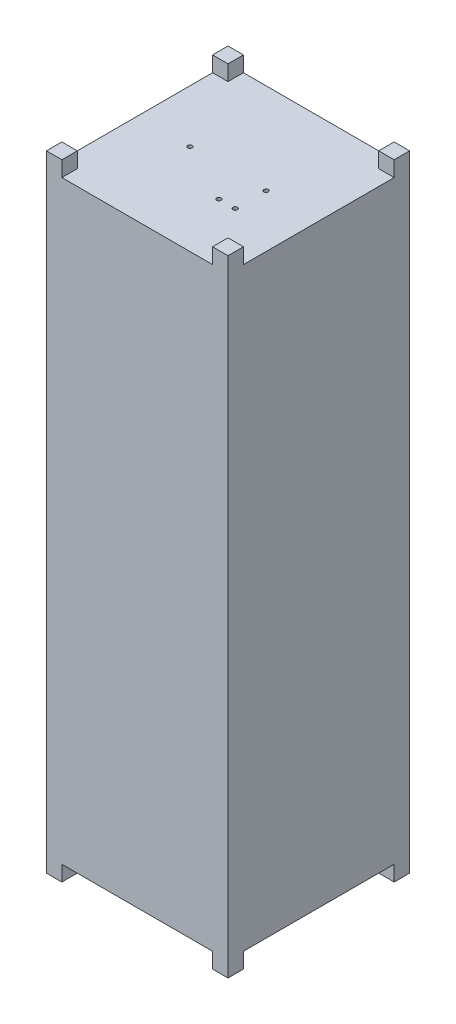
ISO-10303-21;
HEADER;
FILE_DESCRIPTION(('STEP AP214'),'2;1');
FILE_NAME('part.step','',(''),(''),'','','');
FILE_SCHEMA(('AUTOMOTIVE_DESIGN { 1 0 10303 214 1 1 1 1 }'));
ENDSEC;
DATA;
#1=APPLICATION_CONTEXT('core data for automotive mechanical design processes');
#2=APPLICATION_PROTOCOL_DEFINITION('international standard','automotive_design',2000,#1);
#3=PRODUCT_CONTEXT('',#1,'mechanical');
#4=PRODUCT('Part','Part','',(#3));
#5=PRODUCT_RELATED_PRODUCT_CATEGORY('part','',(#4));
#6=PRODUCT_DEFINITION_FORMATION('','',#4);
#7=PRODUCT_DEFINITION_CONTEXT('part definition',#1,'design');
#8=PRODUCT_DEFINITION('design','',#6,#7);
#9=PRODUCT_DEFINITION_SHAPE('','',#8);
#10=(LENGTH_UNIT() NAMED_UNIT(*) SI_UNIT(.MILLI.,.METRE.));
#11=(NAMED_UNIT(*) PLANE_ANGLE_UNIT() SI_UNIT($,.RADIAN.));
#12=(NAMED_UNIT(*) SI_UNIT($,.STERADIAN.) SOLID_ANGLE_UNIT());
#13=UNCERTAINTY_MEASURE_WITH_UNIT(LENGTH_MEASURE(1.E-05),#10,'distance_accuracy_value','');
#14=(GEOMETRIC_REPRESENTATION_CONTEXT(3) GLOBAL_UNCERTAINTY_ASSIGNED_CONTEXT((#13)) GLOBAL_UNIT_ASSIGNED_CONTEXT((#10,
#11,#12)) REPRESENTATION_CONTEXT('',''));
#15=CARTESIAN_POINT('',(0.,0.,0.));
#16=DIRECTION('',(0.,0.,1.));
#17=DIRECTION('',(1.,0.,0.));
#18=AXIS2_PLACEMENT_3D('',#15,#16,#17);
#19=CARTESIAN_POINT('',(0.,-327.5,0.));
#20=DIRECTION('',(0.,0.,1.));
#21=DIRECTION('',(1.,0.,0.));
#22=AXIS2_PLACEMENT_3D('',#19,#20,#21);
#23=PLANE('',#22);
#24=DIRECTION('',(1.,0.,0.));
#25=VECTOR('',#24,1.);
#26=CARTESIAN_POINT('',(0.,-327.5,0.));
#27=LINE('',#26,#25);
#28=CARTESIAN_POINT('',(8.5,-327.5,0.));
#29=VERTEX_POINT('',#28);
#30=CARTESIAN_POINT('',(91.5,-327.5,0.));
#31=VERTEX_POINT('',#30);
#32=EDGE_CURVE('E420',#29,#31,#27,.T.);
#33=ORIENTED_EDGE('',*,*,#32,.T.);
#34=DIRECTION('',(0.,-1.,0.));
#35=VECTOR('',#34,1.);
#36=CARTESIAN_POINT('',(91.5,8.50000000000001,0.));
#37=LINE('',#36,#35);
#38=CARTESIAN_POINT('',(91.5,-336.,0.));
#39=VERTEX_POINT('',#38);
#40=EDGE_CURVE('E231',#31,#39,#37,.T.);
#41=ORIENTED_EDGE('',*,*,#40,.T.);
#42=DIRECTION('',(-1.,0.,0.));
#43=VECTOR('',#42,1.);
#44=CARTESIAN_POINT('',(100.,-336.,0.));
#45=LINE('',#44,#43);
#46=CARTESIAN_POINT('',(100.,-336.,0.));
#47=VERTEX_POINT('',#46);
#48=EDGE_CURVE('E229',#47,#39,#45,.T.);
#49=ORIENTED_EDGE('',*,*,#48,.F.);
#50=DIRECTION('',(0.,1.,0.));
#51=VECTOR('',#50,1.);
#52=CARTESIAN_POINT('',(100.,-327.5,0.));
#53=LINE('',#52,#51);
#54=CARTESIAN_POINT('',(100.,8.50000000000001,0.));
#55=VERTEX_POINT('',#54);
#56=EDGE_CURVE('E214',#47,#55,#53,.T.);
#57=ORIENTED_EDGE('',*,*,#56,.T.);
#58=DIRECTION('',(-1.,0.,0.));
#59=VECTOR('',#58,1.);
#60=CARTESIAN_POINT('',(100.,8.50000000000001,0.));
#61=LINE('',#60,#59);
#62=CARTESIAN_POINT('',(91.5,8.50000000000001,0.));
#63=VERTEX_POINT('',#62);
#64=EDGE_CURVE('E246',#55,#63,#61,.T.);
#65=ORIENTED_EDGE('',*,*,#64,.T.);
#66=CARTESIAN_POINT('',(91.5,0.,0.));
#67=VERTEX_POINT('',#66);
#68=EDGE_CURVE('E263',#63,#67,#37,.T.);
#69=ORIENTED_EDGE('',*,*,#68,.T.);
#70=DIRECTION('',(1.,0.,0.));
#71=VECTOR('',#70,1.);
#72=CARTESIAN_POINT('',(0.,0.,0.));
#73=LINE('',#72,#71);
#74=CARTESIAN_POINT('',(8.5,0.,0.));
#75=VERTEX_POINT('',#74);
#76=EDGE_CURVE('E417',#75,#67,#73,.T.);
#77=ORIENTED_EDGE('',*,*,#76,.F.);
#78=DIRECTION('',(0.,-1.,0.));
#79=VECTOR('',#78,1.);
#80=CARTESIAN_POINT('',(8.5,8.50000000000001,0.));
#81=LINE('',#80,#79);
#82=CARTESIAN_POINT('',(8.5,8.50000000000001,0.));
#83=VERTEX_POINT('',#82);
#84=EDGE_CURVE('E296',#83,#75,#81,.T.);
#85=ORIENTED_EDGE('',*,*,#84,.F.);
#86=DIRECTION('',(-1.,0.,0.));
#87=VECTOR('',#86,1.);
#88=CARTESIAN_POINT('',(0.,8.50000000000001,0.));
#89=LINE('',#88,#87);
#90=CARTESIAN_POINT('',(0.,8.50000000000001,0.));
#91=VERTEX_POINT('',#90);
#92=EDGE_CURVE('E292',#83,#91,#89,.T.);
#93=ORIENTED_EDGE('',*,*,#92,.T.);
#94=DIRECTION('',(0.,1.,0.));
#95=VECTOR('',#94,1.);
#96=CARTESIAN_POINT('',(0.,-327.5,0.));
#97=LINE('',#96,#95);
#98=CARTESIAN_POINT('',(0.,-336.,0.));
#99=VERTEX_POINT('',#98);
#100=EDGE_CURVE('E436',#99,#91,#97,.T.);
#101=ORIENTED_EDGE('',*,*,#100,.F.);
#102=DIRECTION('',(-1.,0.,0.));
#103=VECTOR('',#102,1.);
#104=CARTESIAN_POINT('',(0.,-336.,0.));
#105=LINE('',#104,#103);
#106=CARTESIAN_POINT('',(8.5,-336.,0.));
#107=VERTEX_POINT('',#106);
#108=EDGE_CURVE('E280',#107,#99,#105,.T.);
#109=ORIENTED_EDGE('',*,*,#108,.F.);
#110=EDGE_CURVE('E300',#29,#107,#81,.T.);
#111=ORIENTED_EDGE('',*,*,#110,.F.);
#112=EDGE_LOOP('',(#33,#41,#49,#57,#65,#69,#77,#85,#93,#101,#109,#111));
#113=FACE_BOUND('',#112,.T.);
#114=ADVANCED_FACE('F35',(#113),#23,.T.);
#115=CARTESIAN_POINT('',(0.,-327.5,0.));
#116=DIRECTION('',(1.,0.,0.));
#117=DIRECTION('',(0.,0.,-1.));
#118=AXIS2_PLACEMENT_3D('',#115,#116,#117);
#119=PLANE('',#118);
#120=DIRECTION('',(0.,0.,-1.));
#121=VECTOR('',#120,1.);
#122=CARTESIAN_POINT('',(0.,-327.5,0.));
#123=LINE('',#122,#121);
#124=CARTESIAN_POINT('',(0.,-327.5,-8.5));
#125=VERTEX_POINT('',#124);
#126=CARTESIAN_POINT('',(0.,-327.5,-91.5));
#127=VERTEX_POINT('',#126);
#128=EDGE_CURVE('E226',#125,#127,#123,.T.);
#129=ORIENTED_EDGE('',*,*,#128,.F.);
#130=DIRECTION('',(0.,-1.,0.));
#131=VECTOR('',#130,1.);
#132=CARTESIAN_POINT('',(0.,8.50000000000001,-8.5));
#133=LINE('',#132,#131);
#134=CARTESIAN_POINT('',(0.,-336.,-8.5));
#135=VERTEX_POINT('',#134);
#136=EDGE_CURVE('E295',#125,#135,#133,.T.);
#137=ORIENTED_EDGE('',*,*,#136,.T.);
#138=DIRECTION('',(0.,0.,-1.));
#139=VECTOR('',#138,1.);
#140=CARTESIAN_POINT('',(0.,-336.,0.));
#141=LINE('',#140,#139);
#142=EDGE_CURVE('E271',#99,#135,#141,.T.);
#143=ORIENTED_EDGE('',*,*,#142,.F.);
#144=ORIENTED_EDGE('',*,*,#100,.T.);
#145=DIRECTION('',(0.,0.,-1.));
#146=VECTOR('',#145,1.);
#147=CARTESIAN_POINT('',(0.,8.50000000000001,0.));
#148=LINE('',#147,#146);
#149=CARTESIAN_POINT('',(0.,8.50000000000001,-8.5));
#150=VERTEX_POINT('',#149);
#151=EDGE_CURVE('E283',#91,#150,#148,.T.);
#152=ORIENTED_EDGE('',*,*,#151,.T.);
#153=CARTESIAN_POINT('',(0.,0.,-8.5));
#154=VERTEX_POINT('',#153);
#155=EDGE_CURVE('E305',#150,#154,#133,.T.);
#156=ORIENTED_EDGE('',*,*,#155,.T.);
#157=DIRECTION('',(0.,0.,-1.));
#158=VECTOR('',#157,1.);
#159=CARTESIAN_POINT('',(0.,0.,0.));
#160=LINE('',#159,#158);
#161=CARTESIAN_POINT('',(0.,0.,-91.5));
#162=VERTEX_POINT('',#161);
#163=EDGE_CURVE('E423',#154,#162,#160,.T.);
#164=ORIENTED_EDGE('',*,*,#163,.T.);
#165=DIRECTION('',(0.,-1.,0.));
#166=VECTOR('',#165,1.);
#167=CARTESIAN_POINT('',(0.,8.50000000000001,-91.5));
#168=LINE('',#167,#166);
#169=CARTESIAN_POINT('',(0.,8.50000000000001,-91.5));
#170=VERTEX_POINT('',#169);
#171=EDGE_CURVE('E380',#170,#162,#168,.T.);
#172=ORIENTED_EDGE('',*,*,#171,.F.);
#173=DIRECTION('',(0.,0.,-1.));
#174=VECTOR('',#173,1.);
#175=CARTESIAN_POINT('',(0.,8.50000000000001,-100.));
#176=LINE('',#175,#174);
#177=CARTESIAN_POINT('',(0.,8.50000000000001,-100.));
#178=VERTEX_POINT('',#177);
#179=EDGE_CURVE('E367',#170,#178,#176,.T.);
#180=ORIENTED_EDGE('',*,*,#179,.T.);
#181=DIRECTION('',(0.,1.,0.));
#182=VECTOR('',#181,1.);
#183=CARTESIAN_POINT('',(0.,-327.5,-100.));
#184=LINE('',#183,#182);
#185=CARTESIAN_POINT('',(0.,-336.,-100.));
#186=VERTEX_POINT('',#185);
#187=EDGE_CURVE('E439',#186,#178,#184,.T.);
#188=ORIENTED_EDGE('',*,*,#187,.F.);
#189=DIRECTION('',(0.,0.,-1.));
#190=VECTOR('',#189,1.);
#191=CARTESIAN_POINT('',(0.,-336.,-100.));
#192=LINE('',#191,#190);
#193=CARTESIAN_POINT('',(0.,-336.,-91.5));
#194=VERTEX_POINT('',#193);
#195=EDGE_CURVE('E355',#194,#186,#192,.T.);
#196=ORIENTED_EDGE('',*,*,#195,.F.);
#197=EDGE_CURVE('E384',#127,#194,#168,.T.);
#198=ORIENTED_EDGE('',*,*,#197,.F.);
#199=EDGE_LOOP('',(#129,#137,#143,#144,#152,#156,#164,#172,#180,#188,#196,#198));
#200=FACE_BOUND('',#199,.T.);
#201=ADVANCED_FACE('F493',(#200),#119,.F.);
#202=CARTESIAN_POINT('',(0.,-327.5,-100.));
#203=DIRECTION('',(0.,0.,1.));
#204=DIRECTION('',(1.,0.,0.));
#205=AXIS2_PLACEMENT_3D('',#202,#203,#204);
#206=PLANE('',#205);
#207=DIRECTION('',(1.,0.,0.));
#208=VECTOR('',#207,1.);
#209=CARTESIAN_POINT('',(0.,0.,-100.));
#210=LINE('',#209,#208);
#211=CARTESIAN_POINT('',(8.5,0.,-100.));
#212=VERTEX_POINT('',#211);
#213=CARTESIAN_POINT('',(91.5,0.,-100.));
#214=VERTEX_POINT('',#213);
#215=EDGE_CURVE('E432',#212,#214,#210,.T.);
#216=ORIENTED_EDGE('',*,*,#215,.T.);
#217=DIRECTION('',(0.,-1.,0.));
#218=VECTOR('',#217,1.);
#219=CARTESIAN_POINT('',(91.5,8.50000000000001,-100.));
#220=LINE('',#219,#218);
#221=CARTESIAN_POINT('',(91.5,8.50000000000001,-100.));
#222=VERTEX_POINT('',#221);
#223=EDGE_CURVE('E338',#222,#214,#220,.T.);
#224=ORIENTED_EDGE('',*,*,#223,.F.);
#225=DIRECTION('',(1.,0.,0.));
#226=VECTOR('',#225,1.);
#227=CARTESIAN_POINT('',(100.,8.50000000000001,-100.));
#228=LINE('',#227,#226);
#229=CARTESIAN_POINT('',(100.,8.50000000000001,-100.));
#230=VERTEX_POINT('',#229);
#231=EDGE_CURVE('E334',#222,#230,#228,.T.);
#232=ORIENTED_EDGE('',*,*,#231,.T.);
#233=DIRECTION('',(0.,1.,0.));
#234=VECTOR('',#233,1.);
#235=CARTESIAN_POINT('',(100.,-327.5,-100.));
#236=LINE('',#235,#234);
#237=CARTESIAN_POINT('',(100.,-336.,-100.));
#238=VERTEX_POINT('',#237);
#239=EDGE_CURVE('E225',#238,#230,#236,.T.);
#240=ORIENTED_EDGE('',*,*,#239,.F.);
#241=DIRECTION('',(1.,0.,0.));
#242=VECTOR('',#241,1.);
#243=CARTESIAN_POINT('',(100.,-336.,-100.));
#244=LINE('',#243,#242);
#245=CARTESIAN_POINT('',(91.5,-336.,-100.));
#246=VERTEX_POINT('',#245);
#247=EDGE_CURVE('E322',#246,#238,#244,.T.);
#248=ORIENTED_EDGE('',*,*,#247,.F.);
#249=CARTESIAN_POINT('',(91.5,-327.5,-100.));
#250=VERTEX_POINT('',#249);
#251=EDGE_CURVE('E342',#250,#246,#220,.T.);
#252=ORIENTED_EDGE('',*,*,#251,.F.);
#253=DIRECTION('',(1.,0.,0.));
#254=VECTOR('',#253,1.);
#255=CARTESIAN_POINT('',(0.,-327.5,-100.));
#256=LINE('',#255,#254);
#257=CARTESIAN_POINT('',(8.5,-327.5,-100.));
#258=VERTEX_POINT('',#257);
#259=EDGE_CURVE('E425',#258,#250,#256,.T.);
#260=ORIENTED_EDGE('',*,*,#259,.F.);
#261=DIRECTION('',(0.,-1.,0.));
#262=VECTOR('',#261,1.);
#263=CARTESIAN_POINT('',(8.5,8.50000000000001,-100.));
#264=LINE('',#263,#262);
#265=CARTESIAN_POINT('',(8.5,-336.,-100.));
#266=VERTEX_POINT('',#265);
#267=EDGE_CURVE('E379',#258,#266,#264,.T.);
#268=ORIENTED_EDGE('',*,*,#267,.T.);
#269=DIRECTION('',(1.,0.,0.));
#270=VECTOR('',#269,1.);
#271=CARTESIAN_POINT('',(0.,-336.,-100.));
#272=LINE('',#271,#270);
#273=EDGE_CURVE('E358',#186,#266,#272,.T.);
#274=ORIENTED_EDGE('',*,*,#273,.F.);
#275=ORIENTED_EDGE('',*,*,#187,.T.);
#276=DIRECTION('',(1.,0.,0.));
#277=VECTOR('',#276,1.);
#278=CARTESIAN_POINT('',(0.,8.50000000000001,-100.));
#279=LINE('',#278,#277);
#280=CARTESIAN_POINT('',(8.5,8.50000000000001,-100.));
#281=VERTEX_POINT('',#280);
#282=EDGE_CURVE('E370',#178,#281,#279,.T.);
#283=ORIENTED_EDGE('',*,*,#282,.T.);
#284=EDGE_CURVE('E389',#281,#212,#264,.T.);
#285=ORIENTED_EDGE('',*,*,#284,.T.);
#286=EDGE_LOOP('',(#216,#224,#232,#240,#248,#252,#260,#268,#274,#275,#283,#285));
#287=FACE_BOUND('',#286,.T.);
#288=ADVANCED_FACE('F479',(#287),#206,.F.);
#289=CARTESIAN_POINT('',(100.,-327.5,0.));
#290=DIRECTION('',(1.,0.,0.));
#291=DIRECTION('',(0.,0.,-1.));
#292=AXIS2_PLACEMENT_3D('',#289,#290,#291);
#293=PLANE('',#292);
#294=DIRECTION('',(0.,0.,-1.));
#295=VECTOR('',#294,1.);
#296=CARTESIAN_POINT('',(100.,0.,0.));
#297=LINE('',#296,#295);
#298=CARTESIAN_POINT('',(100.,0.,-8.5));
#299=VERTEX_POINT('',#298);
#300=CARTESIAN_POINT('',(100.,0.,-91.5));
#301=VERTEX_POINT('',#300);
#302=EDGE_CURVE('E430',#299,#301,#297,.T.);
#303=ORIENTED_EDGE('',*,*,#302,.F.);
#304=DIRECTION('',(0.,-1.,0.));
#305=VECTOR('',#304,1.);
#306=CARTESIAN_POINT('',(100.,8.50000000000001,-8.5));
#307=LINE('',#306,#305);
#308=CARTESIAN_POINT('',(100.,8.50000000000001,-8.5));
#309=VERTEX_POINT('',#308);
#310=EDGE_CURVE('E254',#309,#299,#307,.T.);
#311=ORIENTED_EDGE('',*,*,#310,.F.);
#312=DIRECTION('',(0.,0.,1.));
#313=VECTOR('',#312,1.);
#314=CARTESIAN_POINT('',(100.,8.50000000000001,0.));
#315=LINE('',#314,#313);
#316=EDGE_CURVE('E221',#309,#55,#315,.T.);
#317=ORIENTED_EDGE('',*,*,#316,.T.);
#318=ORIENTED_EDGE('',*,*,#56,.F.);
#319=DIRECTION('',(0.,0.,1.));
#320=VECTOR('',#319,1.);
#321=CARTESIAN_POINT('',(100.,-336.,0.));
#322=LINE('',#321,#320);
#323=CARTESIAN_POINT('',(100.,-336.,-8.5));
#324=VERTEX_POINT('',#323);
#325=EDGE_CURVE('E219',#324,#47,#322,.T.);
#326=ORIENTED_EDGE('',*,*,#325,.F.);
#327=CARTESIAN_POINT('',(100.,-327.5,-8.5));
#328=VERTEX_POINT('',#327);
#329=EDGE_CURVE('E258',#328,#324,#307,.T.);
#330=ORIENTED_EDGE('',*,*,#329,.F.);
#331=DIRECTION('',(0.,0.,-1.));
#332=VECTOR('',#331,1.);
#333=CARTESIAN_POINT('',(100.,-327.5,0.));
#334=LINE('',#333,#332);
#335=CARTESIAN_POINT('',(100.,-327.5,-91.5));
#336=VERTEX_POINT('',#335);
#337=EDGE_CURVE('E422',#328,#336,#334,.T.);
#338=ORIENTED_EDGE('',*,*,#337,.T.);
#339=DIRECTION('',(0.,-1.,0.));
#340=VECTOR('',#339,1.);
#341=CARTESIAN_POINT('',(100.,8.50000000000001,-91.5));
#342=LINE('',#341,#340);
#343=CARTESIAN_POINT('',(100.,-336.,-91.5));
#344=VERTEX_POINT('',#343);
#345=EDGE_CURVE('E337',#336,#344,#342,.T.);
#346=ORIENTED_EDGE('',*,*,#345,.T.);
#347=DIRECTION('',(0.,0.,1.));
#348=VECTOR('',#347,1.);
#349=CARTESIAN_POINT('',(100.,-336.,-100.));
#350=LINE('',#349,#348);
#351=EDGE_CURVE('E313',#238,#344,#350,.T.);
#352=ORIENTED_EDGE('',*,*,#351,.F.);
#353=ORIENTED_EDGE('',*,*,#239,.T.);
#354=DIRECTION('',(0.,0.,1.));
#355=VECTOR('',#354,1.);
#356=CARTESIAN_POINT('',(100.,8.50000000000001,-100.));
#357=LINE('',#356,#355);
#358=CARTESIAN_POINT('',(100.,8.50000000000001,-91.5));
#359=VERTEX_POINT('',#358);
#360=EDGE_CURVE('E325',#230,#359,#357,.T.);
#361=ORIENTED_EDGE('',*,*,#360,.T.);
#362=EDGE_CURVE('E347',#359,#301,#342,.T.);
#363=ORIENTED_EDGE('',*,*,#362,.T.);
#364=EDGE_LOOP('',(#303,#311,#317,#318,#326,#330,#338,#346,#352,#353,#361,#363));
#365=FACE_BOUND('',#364,.T.);
#366=ADVANCED_FACE('F216',(#365),#293,.T.);
#367=CARTESIAN_POINT('',(0.,-327.5,0.));
#368=DIRECTION('',(0.,1.,0.));
#369=DIRECTION('',(0.,0.,1.));
#370=AXIS2_PLACEMENT_3D('',#367,#368,#369);
#371=PLANE('',#370);
#372=ORIENTED_EDGE('',*,*,#337,.F.);
#373=DIRECTION('',(-1.,0.,0.));
#374=VECTOR('',#373,1.);
#375=CARTESIAN_POINT('',(0.,-327.5,-8.5000000000001));
#376=LINE('',#375,#374);
#377=CARTESIAN_POINT('',(91.5,-327.5,-8.50000000000001));
#378=VERTEX_POINT('',#377);
#379=EDGE_CURVE('E268',#328,#378,#376,.T.);
#380=ORIENTED_EDGE('',*,*,#379,.T.);
#381=DIRECTION('',(0.,0.,1.));
#382=VECTOR('',#381,1.);
#383=CARTESIAN_POINT('',(91.5,-327.5,0.));
#384=LINE('',#383,#382);
#385=EDGE_CURVE('E257',#378,#31,#384,.T.);
#386=ORIENTED_EDGE('',*,*,#385,.T.);
#387=ORIENTED_EDGE('',*,*,#32,.F.);
#388=DIRECTION('',(0.,0.,-1.));
#389=VECTOR('',#388,1.);
#390=CARTESIAN_POINT('',(8.5,-327.5,0.));
#391=LINE('',#390,#389);
#392=CARTESIAN_POINT('',(8.5,-327.5,-8.5));
#393=VERTEX_POINT('',#392);
#394=EDGE_CURVE('E310',#29,#393,#391,.T.);
#395=ORIENTED_EDGE('',*,*,#394,.T.);
#396=DIRECTION('',(-1.,0.,0.));
#397=VECTOR('',#396,1.);
#398=CARTESIAN_POINT('',(0.,-327.5,-8.5));
#399=LINE('',#398,#397);
#400=EDGE_CURVE('E299',#393,#125,#399,.T.);
#401=ORIENTED_EDGE('',*,*,#400,.T.);
#402=ORIENTED_EDGE('',*,*,#128,.T.);
#403=DIRECTION('',(1.,0.,0.));
#404=VECTOR('',#403,1.);
#405=CARTESIAN_POINT('',(0.,-327.5,-91.5));
#406=LINE('',#405,#404);
#407=CARTESIAN_POINT('',(8.5,-327.5,-91.5));
#408=VERTEX_POINT('',#407);
#409=EDGE_CURVE('E393',#127,#408,#406,.T.);
#410=ORIENTED_EDGE('',*,*,#409,.T.);
#411=DIRECTION('',(0.,0.,-1.));
#412=VECTOR('',#411,1.);
#413=CARTESIAN_POINT('',(8.49999999999996,-327.5,0.));
#414=LINE('',#413,#412);
#415=EDGE_CURVE('E383',#408,#258,#414,.T.);
#416=ORIENTED_EDGE('',*,*,#415,.T.);
#417=ORIENTED_EDGE('',*,*,#259,.T.);
#418=DIRECTION('',(0.,0.,1.));
#419=VECTOR('',#418,1.);
#420=CARTESIAN_POINT('',(91.5,-327.5,0.));
#421=LINE('',#420,#419);
#422=CARTESIAN_POINT('',(91.5,-327.5,-91.5));
#423=VERTEX_POINT('',#422);
#424=EDGE_CURVE('E352',#250,#423,#421,.T.);
#425=ORIENTED_EDGE('',*,*,#424,.T.);
#426=DIRECTION('',(1.,0.,0.));
#427=VECTOR('',#426,1.);
#428=CARTESIAN_POINT('',(0.,-327.5,-91.5));
#429=LINE('',#428,#427);
#430=EDGE_CURVE('E341',#423,#336,#429,.T.);
#431=ORIENTED_EDGE('',*,*,#430,.T.);
#432=EDGE_LOOP('',(#372,#380,#386,#387,#395,#401,#402,#410,#416,#417,#425,#431));
#433=FACE_BOUND('',#432,.T.);
#434=ADVANCED_FACE('F511',(#433),#371,.F.);
#435=CARTESIAN_POINT('',(0.,0.,0.));
#436=DIRECTION('',(0.,1.,0.));
#437=DIRECTION('',(0.,0.,1.));
#438=AXIS2_PLACEMENT_3D('',#435,#436,#437);
#439=PLANE('',#438);
#440=DIRECTION('',(-1.,0.,0.));
#441=VECTOR('',#440,1.);
#442=CARTESIAN_POINT('',(0.,0.,-8.5000000000001));
#443=LINE('',#442,#441);
#444=CARTESIAN_POINT('',(91.5,0.,-8.50000000000001));
#445=VERTEX_POINT('',#444);
#446=EDGE_CURVE('E11',#299,#445,#443,.T.);
#447=ORIENTED_EDGE('',*,*,#446,.F.);
#448=ORIENTED_EDGE('',*,*,#302,.T.);
#449=DIRECTION('',(1.,0.,0.));
#450=VECTOR('',#449,1.);
#451=CARTESIAN_POINT('',(0.,0.,-91.5));
#452=LINE('',#451,#450);
#453=CARTESIAN_POINT('',(91.5,0.,-91.5));
#454=VERTEX_POINT('',#453);
#455=EDGE_CURVE('E446',#454,#301,#452,.T.);
#456=ORIENTED_EDGE('',*,*,#455,.F.);
#457=DIRECTION('',(0.,0.,1.));
#458=VECTOR('',#457,1.);
#459=CARTESIAN_POINT('',(91.5,0.,0.));
#460=LINE('',#459,#458);
#461=EDGE_CURVE('E449',#214,#454,#460,.T.);
#462=ORIENTED_EDGE('',*,*,#461,.F.);
#463=ORIENTED_EDGE('',*,*,#215,.F.);
#464=DIRECTION('',(0.,0.,-1.));
#465=VECTOR('',#464,1.);
#466=CARTESIAN_POINT('',(8.49999999999996,0.,0.));
#467=LINE('',#466,#465);
#468=CARTESIAN_POINT('',(8.5,0.,-91.5));
#469=VERTEX_POINT('',#468);
#470=EDGE_CURVE('E438',#469,#212,#467,.T.);
#471=ORIENTED_EDGE('',*,*,#470,.F.);
#472=DIRECTION('',(1.,0.,0.));
#473=VECTOR('',#472,1.);
#474=CARTESIAN_POINT('',(0.,0.,-91.5));
#475=LINE('',#474,#473);
#476=EDGE_CURVE('E444',#162,#469,#475,.T.);
#477=ORIENTED_EDGE('',*,*,#476,.F.);
#478=ORIENTED_EDGE('',*,*,#163,.F.);
#479=DIRECTION('',(-1.,0.,0.));
#480=VECTOR('',#479,1.);
#481=CARTESIAN_POINT('',(0.,0.,-8.5));
#482=LINE('',#481,#480);
#483=CARTESIAN_POINT('',(8.5,0.,-8.5));
#484=VERTEX_POINT('',#483);
#485=EDGE_CURVE('E452',#484,#154,#482,.T.);
#486=ORIENTED_EDGE('',*,*,#485,.F.);
#487=DIRECTION('',(0.,0.,-1.));
#488=VECTOR('',#487,1.);
#489=CARTESIAN_POINT('',(8.5,0.,0.));
#490=LINE('',#489,#488);
#491=EDGE_CURVE('E455',#75,#484,#490,.T.);
#492=ORIENTED_EDGE('',*,*,#491,.F.);
#493=ORIENTED_EDGE('',*,*,#76,.T.);
#494=DIRECTION('',(0.,0.,1.));
#495=VECTOR('',#494,1.);
#496=CARTESIAN_POINT('',(91.5,0.,0.));
#497=LINE('',#496,#495);
#498=EDGE_CURVE('E42',#445,#67,#497,.T.);
#499=ORIENTED_EDGE('',*,*,#498,.F.);
#500=EDGE_LOOP('',(#447,#448,#456,#462,#463,#471,#477,#478,#486,#492,#493,#499));
#501=FACE_BOUND('',#500,.T.);
#502=CARTESIAN_POINT('',(71.,0.,-33.));
#503=DIRECTION('',(0.,1.,0.));
#504=DIRECTION('',(0.,0.,1.));
#505=AXIS2_PLACEMENT_3D('',#502,#503,#504);
#506=CIRCLE('',#505,1.2);
#507=CARTESIAN_POINT('',(71.,0.,-31.8));
#508=VERTEX_POINT('',#507);
#509=EDGE_CURVE('E395',#508,#508,#506,.T.);
#510=ORIENTED_EDGE('',*,*,#509,.F.);
#511=EDGE_LOOP('',(#510));
#512=FACE_BOUND('',#511,.T.);
#513=CARTESIAN_POINT('',(62.,0.,-33.));
#514=DIRECTION('',(0.,1.,0.));
#515=DIRECTION('',(0.,0.,1.));
#516=AXIS2_PLACEMENT_3D('',#513,#514,#515);
#517=CIRCLE('',#516,1.2);
#518=CARTESIAN_POINT('',(62.,0.,-31.8));
#519=VERTEX_POINT('',#518);
#520=EDGE_CURVE('E406',#519,#519,#517,.T.);
#521=ORIENTED_EDGE('',*,*,#520,.F.);
#522=EDGE_LOOP('',(#521));
#523=FACE_BOUND('',#522,.T.);
#524=CARTESIAN_POINT('',(29.,0.,-50.));
#525=DIRECTION('',(0.,1.,0.));
#526=DIRECTION('',(0.,0.,1.));
#527=AXIS2_PLACEMENT_3D('',#524,#525,#526);
#528=CIRCLE('',#527,1.2);
#529=CARTESIAN_POINT('',(29.,0.,-48.8));
#530=VERTEX_POINT('',#529);
#531=EDGE_CURVE('E400',#530,#530,#528,.T.);
#532=ORIENTED_EDGE('',*,*,#531,.F.);
#533=EDGE_LOOP('',(#532));
#534=FACE_BOUND('',#533,.T.);
#535=CARTESIAN_POINT('',(71.,0.,-50.));
#536=DIRECTION('',(0.,1.,0.));
#537=DIRECTION('',(0.,0.,1.));
#538=AXIS2_PLACEMENT_3D('',#535,#536,#537);
#539=CIRCLE('',#538,1.2);
#540=CARTESIAN_POINT('',(71.,0.,-48.8));
#541=VERTEX_POINT('',#540);
#542=EDGE_CURVE('E399',#541,#541,#539,.T.);
#543=ORIENTED_EDGE('',*,*,#542,.F.);
#544=EDGE_LOOP('',(#543));
#545=FACE_BOUND('',#544,.T.);
#546=ADVANCED_FACE('F466',(#501,#512,#523,#534,#545),#439,.T.);
#547=CARTESIAN_POINT('',(71.,-10.,-50.));
#548=DIRECTION('',(0.,1.,0.));
#549=DIRECTION('',(0.,0.,1.));
#550=AXIS2_PLACEMENT_3D('',#547,#548,#549);
#551=CYLINDRICAL_SURFACE('',#550,1.2);
#552=CARTESIAN_POINT('',(71.,-10.,-50.));
#553=DIRECTION('',(0.,1.,0.));
#554=DIRECTION('',(0.,0.,1.));
#555=AXIS2_PLACEMENT_3D('',#552,#553,#554);
#556=CIRCLE('',#555,1.2);
#557=CARTESIAN_POINT('',(71.,-10.,-48.8));
#558=VERTEX_POINT('',#557);
#559=EDGE_CURVE('E414',#558,#558,#556,.T.);
#560=ORIENTED_EDGE('',*,*,#559,.F.);
#561=EDGE_LOOP('',(#560));
#562=FACE_BOUND('',#561,.T.);
#563=ORIENTED_EDGE('',*,*,#542,.T.);
#564=EDGE_LOOP('',(#563));
#565=FACE_BOUND('',#564,.T.);
#566=ADVANCED_FACE('F561',(#562,#565),#551,.F.);
#567=CARTESIAN_POINT('',(71.,-10.,-50.));
#568=DIRECTION('',(0.,1.,0.));
#569=DIRECTION('',(0.,0.,1.));
#570=AXIS2_PLACEMENT_3D('',#567,#568,#569);
#571=PLANE('',#570);
#572=ORIENTED_EDGE('',*,*,#559,.T.);
#573=EDGE_LOOP('',(#572));
#574=FACE_BOUND('',#573,.T.);
#575=ADVANCED_FACE('F565',(#574),#571,.T.);
#576=CARTESIAN_POINT('',(29.,-10.,-50.));
#577=DIRECTION('',(0.,1.,0.));
#578=DIRECTION('',(0.,0.,1.));
#579=AXIS2_PLACEMENT_3D('',#576,#577,#578);
#580=CYLINDRICAL_SURFACE('',#579,1.2);
#581=CARTESIAN_POINT('',(29.,-10.,-50.));
#582=DIRECTION('',(0.,1.,0.));
#583=DIRECTION('',(0.,0.,1.));
#584=AXIS2_PLACEMENT_3D('',#581,#582,#583);
#585=CIRCLE('',#584,1.2);
#586=CARTESIAN_POINT('',(29.,-10.,-48.8));
#587=VERTEX_POINT('',#586);
#588=EDGE_CURVE('E396',#587,#587,#585,.T.);
#589=ORIENTED_EDGE('',*,*,#588,.F.);
#590=EDGE_LOOP('',(#589));
#591=FACE_BOUND('',#590,.T.);
#592=ORIENTED_EDGE('',*,*,#531,.T.);
#593=EDGE_LOOP('',(#592));
#594=FACE_BOUND('',#593,.T.);
#595=ADVANCED_FACE('F569',(#591,#594),#580,.F.);
#596=CARTESIAN_POINT('',(29.,-10.,-50.));
#597=DIRECTION('',(0.,1.,0.));
#598=DIRECTION('',(0.,0.,1.));
#599=AXIS2_PLACEMENT_3D('',#596,#597,#598);
#600=PLANE('',#599);
#601=ORIENTED_EDGE('',*,*,#588,.T.);
#602=EDGE_LOOP('',(#601));
#603=FACE_BOUND('',#602,.T.);
#604=ADVANCED_FACE('F583',(#603),#600,.T.);
#605=CARTESIAN_POINT('',(62.,-10.,-33.));
#606=DIRECTION('',(0.,1.,0.));
#607=DIRECTION('',(0.,0.,1.));
#608=AXIS2_PLACEMENT_3D('',#605,#606,#607);
#609=CYLINDRICAL_SURFACE('',#608,1.2);
#610=CARTESIAN_POINT('',(62.,-10.,-33.));
#611=DIRECTION('',(0.,1.,0.));
#612=DIRECTION('',(0.,0.,1.));
#613=AXIS2_PLACEMENT_3D('',#610,#611,#612);
#614=CIRCLE('',#613,1.2);
#615=CARTESIAN_POINT('',(62.,-10.,-31.8));
#616=VERTEX_POINT('',#615);
#617=EDGE_CURVE('E403',#616,#616,#614,.T.);
#618=ORIENTED_EDGE('',*,*,#617,.F.);
#619=EDGE_LOOP('',(#618));
#620=FACE_BOUND('',#619,.T.);
#621=ORIENTED_EDGE('',*,*,#520,.T.);
#622=EDGE_LOOP('',(#621));
#623=FACE_BOUND('',#622,.T.);
#624=ADVANCED_FACE('F580',(#620,#623),#609,.F.);
#625=CARTESIAN_POINT('',(62.,-10.,-33.));
#626=DIRECTION('',(0.,1.,0.));
#627=DIRECTION('',(0.,0.,1.));
#628=AXIS2_PLACEMENT_3D('',#625,#626,#627);
#629=PLANE('',#628);
#630=ORIENTED_EDGE('',*,*,#617,.T.);
#631=EDGE_LOOP('',(#630));
#632=FACE_BOUND('',#631,.T.);
#633=ADVANCED_FACE('F575',(#632),#629,.T.);
#634=CARTESIAN_POINT('',(71.,-10.,-33.));
#635=DIRECTION('',(0.,1.,0.));
#636=DIRECTION('',(0.,0.,1.));
#637=AXIS2_PLACEMENT_3D('',#634,#635,#636);
#638=CYLINDRICAL_SURFACE('',#637,1.2);
#639=CARTESIAN_POINT('',(71.,-10.,-33.));
#640=DIRECTION('',(0.,1.,0.));
#641=DIRECTION('',(0.,0.,1.));
#642=AXIS2_PLACEMENT_3D('',#639,#640,#641);
#643=CIRCLE('',#642,1.2);
#644=CARTESIAN_POINT('',(71.,-10.,-31.8));
#645=VERTEX_POINT('',#644);
#646=EDGE_CURVE('E409',#645,#645,#643,.T.);
#647=ORIENTED_EDGE('',*,*,#646,.F.);
#648=EDGE_LOOP('',(#647));
#649=FACE_BOUND('',#648,.T.);
#650=ORIENTED_EDGE('',*,*,#509,.T.);
#651=EDGE_LOOP('',(#650));
#652=FACE_BOUND('',#651,.T.);
#653=ADVANCED_FACE('F571',(#649,#652),#638,.F.);
#654=CARTESIAN_POINT('',(71.,-10.,-33.));
#655=DIRECTION('',(0.,1.,0.));
#656=DIRECTION('',(0.,0.,1.));
#657=AXIS2_PLACEMENT_3D('',#654,#655,#656);
#658=PLANE('',#657);
#659=ORIENTED_EDGE('',*,*,#646,.T.);
#660=EDGE_LOOP('',(#659));
#661=FACE_BOUND('',#660,.T.);
#662=ADVANCED_FACE('F574',(#661),#658,.T.);
#663=CARTESIAN_POINT('',(0.,8.50000000000001,0.));
#664=DIRECTION('',(0.,1.,0.));
#665=DIRECTION('',(0.,0.,1.));
#666=AXIS2_PLACEMENT_3D('',#663,#664,#665);
#667=PLANE('',#666);
#668=ORIENTED_EDGE('',*,*,#179,.F.);
#669=DIRECTION('',(-1.,0.,0.));
#670=VECTOR('',#669,1.);
#671=CARTESIAN_POINT('',(0.,8.50000000000001,-91.5));
#672=LINE('',#671,#670);
#673=CARTESIAN_POINT('',(8.5,8.50000000000001,-91.5));
#674=VERTEX_POINT('',#673);
#675=EDGE_CURVE('E376',#674,#170,#672,.T.);
#676=ORIENTED_EDGE('',*,*,#675,.F.);
#677=DIRECTION('',(0.,0.,1.));
#678=VECTOR('',#677,1.);
#679=CARTESIAN_POINT('',(8.5,8.50000000000001,-100.));
#680=LINE('',#679,#678);
#681=EDGE_CURVE('E373',#281,#674,#680,.T.);
#682=ORIENTED_EDGE('',*,*,#681,.F.);
#683=ORIENTED_EDGE('',*,*,#282,.F.);
#684=EDGE_LOOP('',(#668,#676,#682,#683));
#685=FACE_BOUND('',#684,.T.);
#686=ADVANCED_FACE('F496',(#685),#667,.T.);
#687=CARTESIAN_POINT('',(8.5,8.50000000000001,-100.));
#688=DIRECTION('',(1.,0.,0.));
#689=DIRECTION('',(0.,0.,-1.));
#690=AXIS2_PLACEMENT_3D('',#687,#688,#689);
#691=PLANE('',#690);
#692=DIRECTION('',(0.,-1.,0.));
#693=VECTOR('',#692,1.);
#694=CARTESIAN_POINT('',(8.5,8.50000000000001,-91.5));
#695=LINE('',#694,#693);
#696=EDGE_CURVE('E385',#674,#469,#695,.T.);
#697=ORIENTED_EDGE('',*,*,#696,.T.);
#698=ORIENTED_EDGE('',*,*,#470,.T.);
#699=ORIENTED_EDGE('',*,*,#284,.F.);
#700=ORIENTED_EDGE('',*,*,#681,.T.);
#701=EDGE_LOOP('',(#697,#698,#699,#700));
#702=FACE_BOUND('',#701,.T.);
#703=ADVANCED_FACE('F485',(#702),#691,.T.);
#704=CARTESIAN_POINT('',(0.,8.50000000000001,-91.5));
#705=DIRECTION('',(0.,0.,1.));
#706=DIRECTION('',(1.,0.,0.));
#707=AXIS2_PLACEMENT_3D('',#704,#705,#706);
#708=PLANE('',#707);
#709=ORIENTED_EDGE('',*,*,#171,.T.);
#710=ORIENTED_EDGE('',*,*,#476,.T.);
#711=ORIENTED_EDGE('',*,*,#696,.F.);
#712=ORIENTED_EDGE('',*,*,#675,.T.);
#713=EDGE_LOOP('',(#709,#710,#711,#712));
#714=FACE_BOUND('',#713,.T.);
#715=ADVANCED_FACE('F489',(#714),#708,.T.);
#716=ORIENTED_EDGE('',*,*,#409,.F.);
#717=ORIENTED_EDGE('',*,*,#197,.T.);
#718=DIRECTION('',(-1.,0.,0.));
#719=VECTOR('',#718,1.);
#720=CARTESIAN_POINT('',(0.,-336.,-91.5));
#721=LINE('',#720,#719);
#722=CARTESIAN_POINT('',(8.5,-336.,-91.5));
#723=VERTEX_POINT('',#722);
#724=EDGE_CURVE('E364',#723,#194,#721,.T.);
#725=ORIENTED_EDGE('',*,*,#724,.F.);
#726=EDGE_CURVE('E388',#408,#723,#695,.T.);
#727=ORIENTED_EDGE('',*,*,#726,.F.);
#728=EDGE_LOOP('',(#716,#717,#725,#727));
#729=FACE_BOUND('',#728,.T.);
#730=ADVANCED_FACE('F507',(#729),#708,.T.);
#731=ORIENTED_EDGE('',*,*,#415,.F.);
#732=ORIENTED_EDGE('',*,*,#726,.T.);
#733=DIRECTION('',(0.,0.,1.));
#734=VECTOR('',#733,1.);
#735=CARTESIAN_POINT('',(8.5,-336.,-100.));
#736=LINE('',#735,#734);
#737=EDGE_CURVE('E361',#266,#723,#736,.T.);
#738=ORIENTED_EDGE('',*,*,#737,.F.);
#739=ORIENTED_EDGE('',*,*,#267,.F.);
#740=EDGE_LOOP('',(#731,#732,#738,#739));
#741=FACE_BOUND('',#740,.T.);
#742=ADVANCED_FACE('F514',(#741),#691,.T.);
#743=CARTESIAN_POINT('',(0.,-336.,0.));
#744=DIRECTION('',(0.,1.,0.));
#745=DIRECTION('',(0.,0.,1.));
#746=AXIS2_PLACEMENT_3D('',#743,#744,#745);
#747=PLANE('',#746);
#748=ORIENTED_EDGE('',*,*,#195,.T.);
#749=ORIENTED_EDGE('',*,*,#273,.T.);
#750=ORIENTED_EDGE('',*,*,#737,.T.);
#751=ORIENTED_EDGE('',*,*,#724,.T.);
#752=EDGE_LOOP('',(#748,#749,#750,#751));
#753=FACE_BOUND('',#752,.T.);
#754=ADVANCED_FACE('F501',(#753),#747,.F.);
#755=CARTESIAN_POINT('',(0.,8.50000000000001,0.));
#756=DIRECTION('',(0.,-1.,0.));
#757=DIRECTION('',(0.,0.,-1.));
#758=AXIS2_PLACEMENT_3D('',#755,#756,#757);
#759=PLANE('',#758);
#760=ORIENTED_EDGE('',*,*,#360,.F.);
#761=ORIENTED_EDGE('',*,*,#231,.F.);
#762=DIRECTION('',(0.,0.,-1.));
#763=VECTOR('',#762,1.);
#764=CARTESIAN_POINT('',(91.5,8.50000000000001,-100.));
#765=LINE('',#764,#763);
#766=CARTESIAN_POINT('',(91.5,8.50000000000001,-91.5));
#767=VERTEX_POINT('',#766);
#768=EDGE_CURVE('E331',#767,#222,#765,.T.);
#769=ORIENTED_EDGE('',*,*,#768,.F.);
#770=DIRECTION('',(-1.,0.,0.));
#771=VECTOR('',#770,1.);
#772=CARTESIAN_POINT('',(100.,8.50000000000001,-91.5));
#773=LINE('',#772,#771);
#774=EDGE_CURVE('E328',#359,#767,#773,.T.);
#775=ORIENTED_EDGE('',*,*,#774,.F.);
#776=EDGE_LOOP('',(#760,#761,#769,#775));
#777=FACE_BOUND('',#776,.T.);
#778=ADVANCED_FACE('F477',(#777),#759,.F.);
#779=CARTESIAN_POINT('',(100.,8.50000000000001,-91.5));
#780=DIRECTION('',(0.,0.,1.));
#781=DIRECTION('',(1.,0.,0.));
#782=AXIS2_PLACEMENT_3D('',#779,#780,#781);
#783=PLANE('',#782);
#784=DIRECTION('',(0.,-1.,0.));
#785=VECTOR('',#784,1.);
#786=CARTESIAN_POINT('',(91.5,8.50000000000001,-91.5));
#787=LINE('',#786,#785);
#788=EDGE_CURVE('E343',#767,#454,#787,.T.);
#789=ORIENTED_EDGE('',*,*,#788,.T.);
#790=ORIENTED_EDGE('',*,*,#455,.T.);
#791=ORIENTED_EDGE('',*,*,#362,.F.);
#792=ORIENTED_EDGE('',*,*,#774,.T.);
#793=EDGE_LOOP('',(#789,#790,#791,#792));
#794=FACE_BOUND('',#793,.T.);
#795=ADVANCED_FACE('F469',(#794),#783,.T.);
#796=CARTESIAN_POINT('',(91.5,8.50000000000001,-100.));
#797=DIRECTION('',(-1.,0.,0.));
#798=DIRECTION('',(0.,0.,1.));
#799=AXIS2_PLACEMENT_3D('',#796,#797,#798);
#800=PLANE('',#799);
#801=ORIENTED_EDGE('',*,*,#223,.T.);
#802=ORIENTED_EDGE('',*,*,#461,.T.);
#803=ORIENTED_EDGE('',*,*,#788,.F.);
#804=ORIENTED_EDGE('',*,*,#768,.T.);
#805=EDGE_LOOP('',(#801,#802,#803,#804));
#806=FACE_BOUND('',#805,.T.);
#807=ADVANCED_FACE('F473',(#806),#800,.T.);
#808=ORIENTED_EDGE('',*,*,#424,.F.);
#809=ORIENTED_EDGE('',*,*,#251,.T.);
#810=DIRECTION('',(0.,0.,-1.));
#811=VECTOR('',#810,1.);
#812=CARTESIAN_POINT('',(91.5,-336.,-100.));
#813=LINE('',#812,#811);
#814=CARTESIAN_POINT('',(91.5,-336.,-91.5));
#815=VERTEX_POINT('',#814);
#816=EDGE_CURVE('E319',#815,#246,#813,.T.);
#817=ORIENTED_EDGE('',*,*,#816,.F.);
#818=EDGE_CURVE('E346',#423,#815,#787,.T.);
#819=ORIENTED_EDGE('',*,*,#818,.F.);
#820=EDGE_LOOP('',(#808,#809,#817,#819));
#821=FACE_BOUND('',#820,.T.);
#822=ADVANCED_FACE('F518',(#821),#800,.T.);
#823=ORIENTED_EDGE('',*,*,#430,.F.);
#824=ORIENTED_EDGE('',*,*,#818,.T.);
#825=DIRECTION('',(-1.,0.,0.));
#826=VECTOR('',#825,1.);
#827=CARTESIAN_POINT('',(100.,-336.,-91.5));
#828=LINE('',#827,#826);
#829=EDGE_CURVE('E316',#344,#815,#828,.T.);
#830=ORIENTED_EDGE('',*,*,#829,.F.);
#831=ORIENTED_EDGE('',*,*,#345,.F.);
#832=EDGE_LOOP('',(#823,#824,#830,#831));
#833=FACE_BOUND('',#832,.T.);
#834=ADVANCED_FACE('F522',(#833),#783,.T.);
#835=CARTESIAN_POINT('',(0.,-336.,0.));
#836=DIRECTION('',(0.,-1.,0.));
#837=DIRECTION('',(0.,0.,-1.));
#838=AXIS2_PLACEMENT_3D('',#835,#836,#837);
#839=PLANE('',#838);
#840=ORIENTED_EDGE('',*,*,#351,.T.);
#841=ORIENTED_EDGE('',*,*,#829,.T.);
#842=ORIENTED_EDGE('',*,*,#816,.T.);
#843=ORIENTED_EDGE('',*,*,#247,.T.);
#844=EDGE_LOOP('',(#840,#841,#842,#843));
#845=FACE_BOUND('',#844,.T.);
#846=ADVANCED_FACE('F525',(#845),#839,.T.);
#847=CARTESIAN_POINT('',(0.,8.50000000000001,0.));
#848=DIRECTION('',(0.,-1.,0.));
#849=DIRECTION('',(0.,0.,-1.));
#850=AXIS2_PLACEMENT_3D('',#847,#848,#849);
#851=PLANE('',#850);
#852=ORIENTED_EDGE('',*,*,#151,.F.);
#853=ORIENTED_EDGE('',*,*,#92,.F.);
#854=DIRECTION('',(0.,0.,1.));
#855=VECTOR('',#854,1.);
#856=CARTESIAN_POINT('',(8.5,8.50000000000001,0.));
#857=LINE('',#856,#855);
#858=CARTESIAN_POINT('',(8.5,8.50000000000001,-8.5));
#859=VERTEX_POINT('',#858);
#860=EDGE_CURVE('E289',#859,#83,#857,.T.);
#861=ORIENTED_EDGE('',*,*,#860,.F.);
#862=DIRECTION('',(1.,0.,0.));
#863=VECTOR('',#862,1.);
#864=CARTESIAN_POINT('',(0.,8.50000000000001,-8.5));
#865=LINE('',#864,#863);
#866=EDGE_CURVE('E286',#150,#859,#865,.T.);
#867=ORIENTED_EDGE('',*,*,#866,.F.);
#868=EDGE_LOOP('',(#852,#853,#861,#867));
#869=FACE_BOUND('',#868,.T.);
#870=ADVANCED_FACE('F610',(#869),#851,.F.);
#871=CARTESIAN_POINT('',(0.,8.50000000000001,-8.5));
#872=DIRECTION('',(0.,0.,-1.));
#873=DIRECTION('',(-1.,0.,0.));
#874=AXIS2_PLACEMENT_3D('',#871,#872,#873);
#875=PLANE('',#874);
#876=DIRECTION('',(0.,-1.,0.));
#877=VECTOR('',#876,1.);
#878=CARTESIAN_POINT('',(8.5,8.50000000000001,-8.5));
#879=LINE('',#878,#877);
#880=EDGE_CURVE('E301',#859,#484,#879,.T.);
#881=ORIENTED_EDGE('',*,*,#880,.T.);
#882=ORIENTED_EDGE('',*,*,#485,.T.);
#883=ORIENTED_EDGE('',*,*,#155,.F.);
#884=ORIENTED_EDGE('',*,*,#866,.T.);
#885=EDGE_LOOP('',(#881,#882,#883,#884));
#886=FACE_BOUND('',#885,.T.);
#887=ADVANCED_FACE('F611',(#886),#875,.T.);
#888=CARTESIAN_POINT('',(8.5,8.50000000000001,0.));
#889=DIRECTION('',(1.,0.,0.));
#890=DIRECTION('',(0.,0.,-1.));
#891=AXIS2_PLACEMENT_3D('',#888,#889,#890);
#892=PLANE('',#891);
#893=ORIENTED_EDGE('',*,*,#84,.T.);
#894=ORIENTED_EDGE('',*,*,#491,.T.);
#895=ORIENTED_EDGE('',*,*,#880,.F.);
#896=ORIENTED_EDGE('',*,*,#860,.T.);
#897=EDGE_LOOP('',(#893,#894,#895,#896));
#898=FACE_BOUND('',#897,.T.);
#899=ADVANCED_FACE('F614',(#898),#892,.T.);
#900=ORIENTED_EDGE('',*,*,#394,.F.);
#901=ORIENTED_EDGE('',*,*,#110,.T.);
#902=DIRECTION('',(0.,0.,1.));
#903=VECTOR('',#902,1.);
#904=CARTESIAN_POINT('',(8.5,-336.,0.));
#905=LINE('',#904,#903);
#906=CARTESIAN_POINT('',(8.5,-336.,-8.5));
#907=VERTEX_POINT('',#906);
#908=EDGE_CURVE('E277',#907,#107,#905,.T.);
#909=ORIENTED_EDGE('',*,*,#908,.F.);
#910=EDGE_CURVE('E304',#393,#907,#879,.T.);
#911=ORIENTED_EDGE('',*,*,#910,.F.);
#912=EDGE_LOOP('',(#900,#901,#909,#911));
#913=FACE_BOUND('',#912,.T.);
#914=ADVANCED_FACE('F619',(#913),#892,.T.);
#915=ORIENTED_EDGE('',*,*,#400,.F.);
#916=ORIENTED_EDGE('',*,*,#910,.T.);
#917=DIRECTION('',(1.,0.,0.));
#918=VECTOR('',#917,1.);
#919=CARTESIAN_POINT('',(0.,-336.,-8.5));
#920=LINE('',#919,#918);
#921=EDGE_CURVE('E274',#135,#907,#920,.T.);
#922=ORIENTED_EDGE('',*,*,#921,.F.);
#923=ORIENTED_EDGE('',*,*,#136,.F.);
#924=EDGE_LOOP('',(#915,#916,#922,#923));
#925=FACE_BOUND('',#924,.T.);
#926=ADVANCED_FACE('F616',(#925),#875,.T.);
#927=CARTESIAN_POINT('',(0.,-336.,0.));
#928=DIRECTION('',(0.,-1.,0.));
#929=DIRECTION('',(0.,0.,-1.));
#930=AXIS2_PLACEMENT_3D('',#927,#928,#929);
#931=PLANE('',#930);
#932=ORIENTED_EDGE('',*,*,#142,.T.);
#933=ORIENTED_EDGE('',*,*,#921,.T.);
#934=ORIENTED_EDGE('',*,*,#908,.T.);
#935=ORIENTED_EDGE('',*,*,#108,.T.);
#936=EDGE_LOOP('',(#932,#933,#934,#935));
#937=FACE_BOUND('',#936,.T.);
#938=ADVANCED_FACE('F623',(#937),#931,.T.);
#939=CARTESIAN_POINT('',(0.,8.50000000000001,0.));
#940=DIRECTION('',(0.,1.,0.));
#941=DIRECTION('',(0.,0.,1.));
#942=AXIS2_PLACEMENT_3D('',#939,#940,#941);
#943=PLANE('',#942);
#944=ORIENTED_EDGE('',*,*,#316,.F.);
#945=DIRECTION('',(1.,0.,0.));
#946=VECTOR('',#945,1.);
#947=CARTESIAN_POINT('',(100.,8.50000000000001,-8.5));
#948=LINE('',#947,#946);
#949=CARTESIAN_POINT('',(91.5,8.50000000000001,-8.50000000000001));
#950=VERTEX_POINT('',#949);
#951=EDGE_CURVE('E251',#950,#309,#948,.T.);
#952=ORIENTED_EDGE('',*,*,#951,.F.);
#953=DIRECTION('',(0.,0.,-1.));
#954=VECTOR('',#953,1.);
#955=CARTESIAN_POINT('',(91.5,8.50000000000001,0.));
#956=LINE('',#955,#954);
#957=EDGE_CURVE('E248',#63,#950,#956,.T.);
#958=ORIENTED_EDGE('',*,*,#957,.F.);
#959=ORIENTED_EDGE('',*,*,#64,.F.);
#960=EDGE_LOOP('',(#944,#952,#958,#959));
#961=FACE_BOUND('',#960,.T.);
#962=ADVANCED_FACE('F462',(#961),#943,.T.);
#963=CARTESIAN_POINT('',(91.5,8.50000000000001,0.));
#964=DIRECTION('',(-1.,0.,0.));
#965=DIRECTION('',(0.,0.,1.));
#966=AXIS2_PLACEMENT_3D('',#963,#964,#965);
#967=PLANE('',#966);
#968=DIRECTION('',(0.,-1.,0.));
#969=VECTOR('',#968,1.);
#970=CARTESIAN_POINT('',(91.5,8.50000000000001,-8.50000000000001));
#971=LINE('',#970,#969);
#972=EDGE_CURVE('E259',#950,#445,#971,.T.);
#973=ORIENTED_EDGE('',*,*,#972,.T.);
#974=ORIENTED_EDGE('',*,*,#498,.T.);
#975=ORIENTED_EDGE('',*,*,#68,.F.);
#976=ORIENTED_EDGE('',*,*,#957,.T.);
#977=EDGE_LOOP('',(#973,#974,#975,#976));
#978=FACE_BOUND('',#977,.T.);
#979=ADVANCED_FACE('F458',(#978),#967,.T.);
#980=CARTESIAN_POINT('',(100.,8.50000000000001,-8.5));
#981=DIRECTION('',(0.,0.,-1.));
#982=DIRECTION('',(-1.,0.,0.));
#983=AXIS2_PLACEMENT_3D('',#980,#981,#982);
#984=PLANE('',#983);
#985=ORIENTED_EDGE('',*,*,#310,.T.);
#986=ORIENTED_EDGE('',*,*,#446,.T.);
#987=ORIENTED_EDGE('',*,*,#972,.F.);
#988=ORIENTED_EDGE('',*,*,#951,.T.);
#989=EDGE_LOOP('',(#985,#986,#987,#988));
#990=FACE_BOUND('',#989,.T.);
#991=ADVANCED_FACE('F465',(#990),#984,.T.);
#992=ORIENTED_EDGE('',*,*,#379,.F.);
#993=ORIENTED_EDGE('',*,*,#329,.T.);
#994=DIRECTION('',(1.,0.,0.));
#995=VECTOR('',#994,1.);
#996=CARTESIAN_POINT('',(100.,-336.,-8.5));
#997=LINE('',#996,#995);
#998=CARTESIAN_POINT('',(91.5,-336.,-8.50000000000001));
#999=VERTEX_POINT('',#998);
#1000=EDGE_CURVE('E240',#999,#324,#997,.T.);
#1001=ORIENTED_EDGE('',*,*,#1000,.F.);
#1002=EDGE_CURVE('E262',#378,#999,#971,.T.);
#1003=ORIENTED_EDGE('',*,*,#1002,.F.);
#1004=EDGE_LOOP('',(#992,#993,#1001,#1003));
#1005=FACE_BOUND('',#1004,.T.);
#1006=ADVANCED_FACE('F530',(#1005),#984,.T.);
#1007=ORIENTED_EDGE('',*,*,#385,.F.);
#1008=ORIENTED_EDGE('',*,*,#1002,.T.);
#1009=DIRECTION('',(0.,0.,-1.));
#1010=VECTOR('',#1009,1.);
#1011=CARTESIAN_POINT('',(91.5,-336.,0.));
#1012=LINE('',#1011,#1010);
#1013=EDGE_CURVE('E235',#39,#999,#1012,.T.);
#1014=ORIENTED_EDGE('',*,*,#1013,.F.);
#1015=ORIENTED_EDGE('',*,*,#40,.F.);
#1016=EDGE_LOOP('',(#1007,#1008,#1014,#1015));
#1017=FACE_BOUND('',#1016,.T.);
#1018=ADVANCED_FACE('F532',(#1017),#967,.T.);
#1019=CARTESIAN_POINT('',(0.,-336.,0.));
#1020=DIRECTION('',(0.,1.,0.));
#1021=DIRECTION('',(0.,0.,1.));
#1022=AXIS2_PLACEMENT_3D('',#1019,#1020,#1021);
#1023=PLANE('',#1022);
#1024=ORIENTED_EDGE('',*,*,#325,.T.);
#1025=ORIENTED_EDGE('',*,*,#48,.T.);
#1026=ORIENTED_EDGE('',*,*,#1013,.T.);
#1027=ORIENTED_EDGE('',*,*,#1000,.T.);
#1028=EDGE_LOOP('',(#1024,#1025,#1026,#1027));
#1029=FACE_BOUND('',#1028,.T.);
#1030=ADVANCED_FACE('F238',(#1029),#1023,.F.);
#1031=CLOSED_SHELL('',(#114,#201,#288,#366,#434,#546,#566,#575,#595,#604,#624,#633,#653,#662,
#686,#703,#715,#730,#742,#754,#778,#795,#807,#822,#834,#846,#870,#887,#899,#914,#926,#938,#962,
#979,#991,#1006,#1018,#1030));
#1032=MANIFOLD_SOLID_BREP('B2',#1031);
#1033=ADVANCED_BREP_SHAPE_REPRESENTATION('',(#18,#1032),#14);
#1034=SHAPE_DEFINITION_REPRESENTATION(#9,#1033);
ENDSEC;
END-ISO-10303-21;
